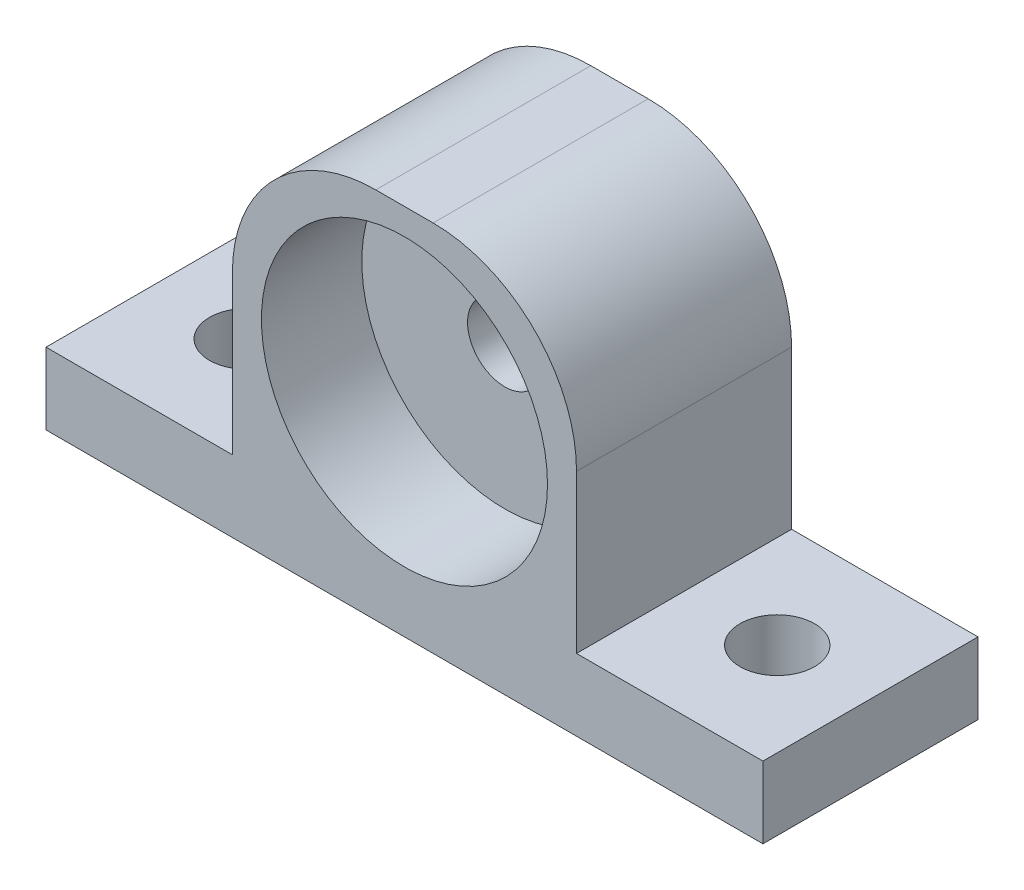
ISO-10303-21;
HEADER;
FILE_DESCRIPTION(('STEP AP214'),'2;1');
FILE_NAME('part.step','',(''),(''),'','','');
FILE_SCHEMA(('AUTOMOTIVE_DESIGN { 1 0 10303 214 1 1 1 1 }'));
ENDSEC;
DATA;
#1=APPLICATION_CONTEXT('core data for automotive mechanical design processes');
#2=APPLICATION_PROTOCOL_DEFINITION('international standard','automotive_design',2000,#1);
#3=PRODUCT_CONTEXT('',#1,'mechanical');
#4=PRODUCT('Part','Part','',(#3));
#5=PRODUCT_RELATED_PRODUCT_CATEGORY('part','',(#4));
#6=PRODUCT_DEFINITION_FORMATION('','',#4);
#7=PRODUCT_DEFINITION_CONTEXT('part definition',#1,'design');
#8=PRODUCT_DEFINITION('design','',#6,#7);
#9=PRODUCT_DEFINITION_SHAPE('','',#8);
#10=(LENGTH_UNIT() NAMED_UNIT(*) SI_UNIT(.MILLI.,.METRE.));
#11=(NAMED_UNIT(*) PLANE_ANGLE_UNIT() SI_UNIT($,.RADIAN.));
#12=(NAMED_UNIT(*) SI_UNIT($,.STERADIAN.) SOLID_ANGLE_UNIT());
#13=UNCERTAINTY_MEASURE_WITH_UNIT(LENGTH_MEASURE(1.E-05),#10,'distance_accuracy_value','');
#14=(GEOMETRIC_REPRESENTATION_CONTEXT(3) GLOBAL_UNCERTAINTY_ASSIGNED_CONTEXT((#13)) GLOBAL_UNIT_ASSIGNED_CONTEXT((#10,
#11,#12)) REPRESENTATION_CONTEXT('',''));
#15=CARTESIAN_POINT('',(0.,0.,0.));
#16=DIRECTION('',(0.,0.,1.));
#17=DIRECTION('',(1.,0.,0.));
#18=AXIS2_PLACEMENT_3D('',#15,#16,#17);
#19=CARTESIAN_POINT('',(0.,6.35,0.));
#20=DIRECTION('',(0.,1.,0.));
#21=DIRECTION('',(0.,0.,1.));
#22=AXIS2_PLACEMENT_3D('',#19,#20,#21);
#23=PLANE('',#22);
#24=CARTESIAN_POINT('',(-54.0324069068638,6.35,-4.28689363659891));
#25=DIRECTION('',(0.,1.,0.));
#26=DIRECTION('',(0.,0.,1.));
#27=AXIS2_PLACEMENT_3D('',#24,#25,#26);
#28=CIRCLE('',#27,3.302);
#29=CARTESIAN_POINT('',(-54.0324069068638,6.35,-0.984893636598909));
#30=VERTEX_POINT('',#29);
#31=EDGE_CURVE('E304',#30,#30,#28,.T.);
#32=ORIENTED_EDGE('',*,*,#31,.F.);
#33=EDGE_LOOP('',(#32));
#34=FACE_BOUND('',#33,.T.);
#35=DIRECTION('',(0.,0.,1.));
#36=VECTOR('',#35,1.);
#37=CARTESIAN_POINT('',(-45.7774069068638,6.35,-13.8118936365989));
#38=LINE('',#37,#36);
#39=CARTESIAN_POINT('',(-45.7774069068638,6.35,-13.8118936365989));
#40=VERTEX_POINT('',#39);
#41=CARTESIAN_POINT('',(-45.7774069068638,6.35,5.23810636340109));
#42=VERTEX_POINT('',#41);
#43=EDGE_CURVE('E133',#40,#42,#38,.T.);
#44=ORIENTED_EDGE('',*,*,#43,.F.);
#45=DIRECTION('',(-1.,0.,0.));
#46=VECTOR('',#45,1.);
#47=CARTESIAN_POINT('',(-62.2874069068638,6.35,-13.8118936365989));
#48=LINE('',#47,#46);
#49=CARTESIAN_POINT('',(-62.2874069068638,6.35,-13.8118936365989));
#50=VERTEX_POINT('',#49);
#51=EDGE_CURVE('E128',#40,#50,#48,.T.);
#52=ORIENTED_EDGE('',*,*,#51,.T.);
#53=DIRECTION('',(0.,0.,1.));
#54=VECTOR('',#53,1.);
#55=CARTESIAN_POINT('',(-62.2874069068638,6.35,-13.8118936365989));
#56=LINE('',#55,#54);
#57=CARTESIAN_POINT('',(-62.2874069068638,6.35,5.23810636340109));
#58=VERTEX_POINT('',#57);
#59=EDGE_CURVE('E152',#50,#58,#56,.T.);
#60=ORIENTED_EDGE('',*,*,#59,.T.);
#61=DIRECTION('',(1.,0.,0.));
#62=VECTOR('',#61,1.);
#63=CARTESIAN_POINT('',(-62.2874069068638,6.35,5.23810636340109));
#64=LINE('',#63,#62);
#65=EDGE_CURVE('E162',#58,#42,#64,.T.);
#66=ORIENTED_EDGE('',*,*,#65,.T.);
#67=EDGE_LOOP('',(#44,#52,#60,#66));
#68=FACE_BOUND('',#67,.T.);
#69=ADVANCED_FACE('F33',(#34,#68),#23,.T.);
#70=CARTESIAN_POINT('',(-62.2874069068638,6.35,-13.8118936365989));
#71=DIRECTION('',(1.,0.,0.));
#72=DIRECTION('',(0.,0.,-1.));
#73=AXIS2_PLACEMENT_3D('',#70,#71,#72);
#74=PLANE('',#73);
#75=DIRECTION('',(0.,0.,1.));
#76=VECTOR('',#75,1.);
#77=CARTESIAN_POINT('',(-62.2874069068638,0.,-13.8118936365989));
#78=LINE('',#77,#76);
#79=CARTESIAN_POINT('',(-62.2874069068638,0.,-13.8118936365989));
#80=VERTEX_POINT('',#79);
#81=CARTESIAN_POINT('',(-62.2874069068638,0.,5.23810636340109));
#82=VERTEX_POINT('',#81);
#83=EDGE_CURVE('E181',#80,#82,#78,.T.);
#84=ORIENTED_EDGE('',*,*,#83,.T.);
#85=DIRECTION('',(0.,-1.,0.));
#86=VECTOR('',#85,1.);
#87=CARTESIAN_POINT('',(-62.2874069068638,6.35,5.23810636340109));
#88=LINE('',#87,#86);
#89=EDGE_CURVE('E165',#58,#82,#88,.T.);
#90=ORIENTED_EDGE('',*,*,#89,.F.);
#91=ORIENTED_EDGE('',*,*,#59,.F.);
#92=DIRECTION('',(0.,-1.,0.));
#93=VECTOR('',#92,1.);
#94=CARTESIAN_POINT('',(-62.2874069068638,6.35,-13.8118936365989));
#95=LINE('',#94,#93);
#96=EDGE_CURVE('E127',#50,#80,#95,.T.);
#97=ORIENTED_EDGE('',*,*,#96,.T.);
#98=EDGE_LOOP('',(#84,#90,#91,#97));
#99=FACE_BOUND('',#98,.T.);
#100=ADVANCED_FACE('F229',(#99),#74,.F.);
#101=CARTESIAN_POINT('',(-62.2874069068638,6.35,5.23810636340109));
#102=DIRECTION('',(0.,0.,-1.));
#103=DIRECTION('',(-1.,0.,0.));
#104=AXIS2_PLACEMENT_3D('',#101,#102,#103);
#105=PLANE('',#104);
#106=CARTESIAN_POINT('',(-30.5374069068637,18.034,5.23810636340109));
#107=DIRECTION('',(0.,0.,1.));
#108=DIRECTION('',(1.,0.,0.));
#109=AXIS2_PLACEMENT_3D('',#106,#107,#108);
#110=CIRCLE('',#109,12.6691049414785);
#111=CARTESIAN_POINT('',(-17.8683019653852,18.034,5.23810636340109));
#112=VERTEX_POINT('',#111);
#113=EDGE_CURVE('E290',#112,#112,#110,.T.);
#114=ORIENTED_EDGE('',*,*,#113,.F.);
#115=EDGE_LOOP('',(#114));
#116=FACE_BOUND('',#115,.T.);
#117=DIRECTION('',(1.,0.,0.));
#118=VECTOR('',#117,1.);
#119=CARTESIAN_POINT('',(-45.7774069068638,33.02,5.23810636340109));
#120=LINE('',#119,#118);
#121=CARTESIAN_POINT('',(-33.0774069068638,33.02,5.23810636340109));
#122=VERTEX_POINT('',#121);
#123=CARTESIAN_POINT('',(-27.9974069068637,33.02,5.23810636340109));
#124=VERTEX_POINT('',#123);
#125=EDGE_CURVE('E132',#122,#124,#120,.T.);
#126=ORIENTED_EDGE('',*,*,#125,.F.);
#127=CARTESIAN_POINT('',(-33.0774069068638,20.32,5.23810636340109));
#128=DIRECTION('',(0.,0.,-1.));
#129=DIRECTION('',(-1.,0.,0.));
#130=AXIS2_PLACEMENT_3D('',#127,#128,#129);
#131=CIRCLE('',#130,12.7);
#132=CARTESIAN_POINT('',(-45.7774069068638,20.32,5.23810636340109));
#133=VERTEX_POINT('',#132);
#134=EDGE_CURVE('E206',#122,#133,#131,.F.);
#135=ORIENTED_EDGE('',*,*,#134,.T.);
#136=DIRECTION('',(0.,-1.,0.));
#137=VECTOR('',#136,1.);
#138=CARTESIAN_POINT('',(-45.7774069068638,33.02,5.23810636340109));
#139=LINE('',#138,#137);
#140=EDGE_CURVE('E183',#133,#42,#139,.T.);
#141=ORIENTED_EDGE('',*,*,#140,.T.);
#142=ORIENTED_EDGE('',*,*,#65,.F.);
#143=ORIENTED_EDGE('',*,*,#89,.T.);
#144=DIRECTION('',(1.,0.,0.));
#145=VECTOR('',#144,1.);
#146=CARTESIAN_POINT('',(-62.2874069068638,0.,5.23810636340109));
#147=LINE('',#146,#145);
#148=CARTESIAN_POINT('',(1.21259309313625,0.,5.23810636340109));
#149=VERTEX_POINT('',#148);
#150=EDGE_CURVE('E179',#82,#149,#147,.T.);
#151=ORIENTED_EDGE('',*,*,#150,.T.);
#152=DIRECTION('',(0.,-1.,0.));
#153=VECTOR('',#152,1.);
#154=CARTESIAN_POINT('',(1.21259309313625,6.35,5.23810636340109));
#155=LINE('',#154,#153);
#156=CARTESIAN_POINT('',(1.21259309313625,6.35,5.23810636340109));
#157=VERTEX_POINT('',#156);
#158=EDGE_CURVE('E169',#157,#149,#155,.T.);
#159=ORIENTED_EDGE('',*,*,#158,.F.);
#160=CARTESIAN_POINT('',(-15.2974069068638,6.35,5.23810636340109));
#161=VERTEX_POINT('',#160);
#162=EDGE_CURVE('E155',#161,#157,#64,.T.);
#163=ORIENTED_EDGE('',*,*,#162,.F.);
#164=DIRECTION('',(0.,-1.,0.));
#165=VECTOR('',#164,1.);
#166=CARTESIAN_POINT('',(-15.2974069068638,33.02,5.23810636340109));
#167=LINE('',#166,#165);
#168=CARTESIAN_POINT('',(-15.2974069068638,20.32,5.23810636340109));
#169=VERTEX_POINT('',#168);
#170=EDGE_CURVE('E116',#169,#161,#167,.T.);
#171=ORIENTED_EDGE('',*,*,#170,.F.);
#172=CARTESIAN_POINT('',(-27.9974069068637,20.32,5.23810636340109));
#173=DIRECTION('',(0.,0.,-1.));
#174=DIRECTION('',(-1.,0.,0.));
#175=AXIS2_PLACEMENT_3D('',#172,#173,#174);
#176=CIRCLE('',#175,12.7);
#177=EDGE_CURVE('E195',#169,#124,#176,.F.);
#178=ORIENTED_EDGE('',*,*,#177,.T.);
#179=EDGE_LOOP('',(#126,#135,#141,#142,#143,#151,#159,#163,#171,#178));
#180=FACE_BOUND('',#179,.T.);
#181=ADVANCED_FACE('F222',(#116,#180),#105,.F.);
#182=CARTESIAN_POINT('',(1.21259309313624,6.35,-13.8118936365989));
#183=DIRECTION('',(-1.,0.,0.));
#184=DIRECTION('',(0.,0.,1.));
#185=AXIS2_PLACEMENT_3D('',#182,#183,#184);
#186=PLANE('',#185);
#187=DIRECTION('',(0.,0.,-1.));
#188=VECTOR('',#187,1.);
#189=CARTESIAN_POINT('',(1.21259309313624,0.,-13.8118936365989));
#190=LINE('',#189,#188);
#191=CARTESIAN_POINT('',(1.21259309313624,0.,-13.8118936365989));
#192=VERTEX_POINT('',#191);
#193=EDGE_CURVE('E177',#149,#192,#190,.T.);
#194=ORIENTED_EDGE('',*,*,#193,.T.);
#195=DIRECTION('',(0.,-1.,0.));
#196=VECTOR('',#195,1.);
#197=CARTESIAN_POINT('',(1.21259309313624,6.35,-13.8118936365989));
#198=LINE('',#197,#196);
#199=CARTESIAN_POINT('',(1.21259309313624,6.35,-13.8118936365989));
#200=VERTEX_POINT('',#199);
#201=EDGE_CURVE('E172',#200,#192,#198,.T.);
#202=ORIENTED_EDGE('',*,*,#201,.F.);
#203=DIRECTION('',(0.,0.,-1.));
#204=VECTOR('',#203,1.);
#205=CARTESIAN_POINT('',(1.21259309313624,6.35,-13.8118936365989));
#206=LINE('',#205,#204);
#207=EDGE_CURVE('E125',#157,#200,#206,.T.);
#208=ORIENTED_EDGE('',*,*,#207,.F.);
#209=ORIENTED_EDGE('',*,*,#158,.T.);
#210=EDGE_LOOP('',(#194,#202,#208,#209));
#211=FACE_BOUND('',#210,.T.);
#212=ADVANCED_FACE('F234',(#211),#186,.F.);
#213=CARTESIAN_POINT('',(-62.2874069068638,6.35,-13.8118936365989));
#214=DIRECTION('',(0.,0.,1.));
#215=DIRECTION('',(1.,0.,0.));
#216=AXIS2_PLACEMENT_3D('',#213,#214,#215);
#217=PLANE('',#216);
#218=CARTESIAN_POINT('',(-30.5374069068637,18.034,-13.8118936365989));
#219=DIRECTION('',(0.,0.,1.));
#220=DIRECTION('',(1.,0.,0.));
#221=AXIS2_PLACEMENT_3D('',#218,#219,#220);
#222=CIRCLE('',#221,3.302);
#223=CARTESIAN_POINT('',(-27.2354069068637,18.034,-13.8118936365989));
#224=VERTEX_POINT('',#223);
#225=EDGE_CURVE('E288',#224,#224,#222,.T.);
#226=ORIENTED_EDGE('',*,*,#225,.T.);
#227=EDGE_LOOP('',(#226));
#228=FACE_BOUND('',#227,.T.);
#229=DIRECTION('',(0.,-1.,0.));
#230=VECTOR('',#229,1.);
#231=CARTESIAN_POINT('',(-45.7774069068638,33.02,-13.8118936365989));
#232=LINE('',#231,#230);
#233=CARTESIAN_POINT('',(-45.7774069068638,20.32,-13.8118936365989));
#234=VERTEX_POINT('',#233);
#235=EDGE_CURVE('E117',#234,#40,#232,.T.);
#236=ORIENTED_EDGE('',*,*,#235,.F.);
#237=CARTESIAN_POINT('',(-33.0774069068638,20.32,-13.8118936365989));
#238=DIRECTION('',(0.,0.,1.));
#239=DIRECTION('',(1.,0.,0.));
#240=AXIS2_PLACEMENT_3D('',#237,#238,#239);
#241=CIRCLE('',#240,12.7);
#242=CARTESIAN_POINT('',(-33.0774069068638,33.02,-13.8118936365989));
#243=VERTEX_POINT('',#242);
#244=EDGE_CURVE('E41',#234,#243,#241,.F.);
#245=ORIENTED_EDGE('',*,*,#244,.T.);
#246=DIRECTION('',(-1.,0.,0.));
#247=VECTOR('',#246,1.);
#248=CARTESIAN_POINT('',(-45.7774069068638,33.02,-13.8118936365989));
#249=LINE('',#248,#247);
#250=CARTESIAN_POINT('',(-27.9974069068637,33.02,-13.8118936365989));
#251=VERTEX_POINT('',#250);
#252=EDGE_CURVE('E136',#251,#243,#249,.T.);
#253=ORIENTED_EDGE('',*,*,#252,.F.);
#254=CARTESIAN_POINT('',(-27.9974069068637,20.32,-13.8118936365989));
#255=DIRECTION('',(0.,0.,1.));
#256=DIRECTION('',(1.,0.,0.));
#257=AXIS2_PLACEMENT_3D('',#254,#255,#256);
#258=CIRCLE('',#257,12.7);
#259=CARTESIAN_POINT('',(-15.2974069068638,20.32,-13.8118936365989));
#260=VERTEX_POINT('',#259);
#261=EDGE_CURVE('E48',#251,#260,#258,.F.);
#262=ORIENTED_EDGE('',*,*,#261,.T.);
#263=DIRECTION('',(0.,-1.,0.));
#264=VECTOR('',#263,1.);
#265=CARTESIAN_POINT('',(-15.2974069068638,33.02,-13.8118936365989));
#266=LINE('',#265,#264);
#267=CARTESIAN_POINT('',(-15.2974069068638,6.35,-13.8118936365989));
#268=VERTEX_POINT('',#267);
#269=EDGE_CURVE('E108',#260,#268,#266,.T.);
#270=ORIENTED_EDGE('',*,*,#269,.T.);
#271=EDGE_CURVE('E112',#200,#268,#48,.T.);
#272=ORIENTED_EDGE('',*,*,#271,.F.);
#273=ORIENTED_EDGE('',*,*,#201,.T.);
#274=DIRECTION('',(-1.,0.,0.));
#275=VECTOR('',#274,1.);
#276=CARTESIAN_POINT('',(-62.2874069068638,0.,-13.8118936365989));
#277=LINE('',#276,#275);
#278=EDGE_CURVE('E156',#192,#80,#277,.T.);
#279=ORIENTED_EDGE('',*,*,#278,.T.);
#280=ORIENTED_EDGE('',*,*,#96,.F.);
#281=ORIENTED_EDGE('',*,*,#51,.F.);
#282=EDGE_LOOP('',(#236,#245,#253,#262,#270,#272,#273,#279,#280,#281));
#283=FACE_BOUND('',#282,.T.);
#284=ADVANCED_FACE('F110',(#228,#283),#217,.F.);
#285=CARTESIAN_POINT('',(-7.04240690686375,6.35,-4.28689363659891));
#286=DIRECTION('',(0.,1.,0.));
#287=DIRECTION('',(0.,0.,1.));
#288=AXIS2_PLACEMENT_3D('',#285,#286,#287);
#289=CIRCLE('',#288,3.302);
#290=CARTESIAN_POINT('',(-7.04240690686375,6.35,-0.984893636598907));
#291=VERTEX_POINT('',#290);
#292=EDGE_CURVE('E297',#291,#291,#289,.T.);
#293=ORIENTED_EDGE('',*,*,#292,.F.);
#294=EDGE_LOOP('',(#293));
#295=FACE_BOUND('',#294,.T.);
#296=DIRECTION('',(0.,0.,-1.));
#297=VECTOR('',#296,1.);
#298=CARTESIAN_POINT('',(-15.2974069068638,6.35,-13.8118936365989));
#299=LINE('',#298,#297);
#300=EDGE_CURVE('E122',#161,#268,#299,.T.);
#301=ORIENTED_EDGE('',*,*,#300,.F.);
#302=ORIENTED_EDGE('',*,*,#162,.T.);
#303=ORIENTED_EDGE('',*,*,#207,.T.);
#304=ORIENTED_EDGE('',*,*,#271,.T.);
#305=EDGE_LOOP('',(#301,#302,#303,#304));
#306=FACE_BOUND('',#305,.T.);
#307=ADVANCED_FACE('F121',(#295,#306),#23,.T.);
#308=CARTESIAN_POINT('',(0.,0.,0.));
#309=DIRECTION('',(0.,1.,0.));
#310=DIRECTION('',(0.,0.,1.));
#311=AXIS2_PLACEMENT_3D('',#308,#309,#310);
#312=PLANE('',#311);
#313=CARTESIAN_POINT('',(-7.04240690686375,0.,-4.28689363659891));
#314=DIRECTION('',(0.,1.,0.));
#315=DIRECTION('',(0.,0.,1.));
#316=AXIS2_PLACEMENT_3D('',#313,#314,#315);
#317=CIRCLE('',#316,3.302);
#318=CARTESIAN_POINT('',(-7.04240690686375,0.,-0.984893636598907));
#319=VERTEX_POINT('',#318);
#320=EDGE_CURVE('E301',#319,#319,#317,.F.);
#321=ORIENTED_EDGE('',*,*,#320,.F.);
#322=EDGE_LOOP('',(#321));
#323=FACE_BOUND('',#322,.T.);
#324=CARTESIAN_POINT('',(-54.0324069068638,0.,-4.28689363659891));
#325=DIRECTION('',(0.,1.,0.));
#326=DIRECTION('',(0.,0.,1.));
#327=AXIS2_PLACEMENT_3D('',#324,#325,#326);
#328=CIRCLE('',#327,3.302);
#329=CARTESIAN_POINT('',(-54.0324069068638,0.,-0.984893636598909));
#330=VERTEX_POINT('',#329);
#331=EDGE_CURVE('E139',#330,#330,#328,.F.);
#332=ORIENTED_EDGE('',*,*,#331,.F.);
#333=EDGE_LOOP('',(#332));
#334=FACE_BOUND('',#333,.T.);
#335=ORIENTED_EDGE('',*,*,#83,.F.);
#336=ORIENTED_EDGE('',*,*,#278,.F.);
#337=ORIENTED_EDGE('',*,*,#193,.F.);
#338=ORIENTED_EDGE('',*,*,#150,.F.);
#339=EDGE_LOOP('',(#335,#336,#337,#338));
#340=FACE_BOUND('',#339,.T.);
#341=ADVANCED_FACE('F235',(#323,#334,#340),#312,.F.);
#342=CARTESIAN_POINT('',(-45.7774069068638,33.02,-13.8118936365989));
#343=DIRECTION('',(1.,0.,0.));
#344=DIRECTION('',(0.,0.,-1.));
#345=AXIS2_PLACEMENT_3D('',#342,#343,#344);
#346=PLANE('',#345);
#347=ORIENTED_EDGE('',*,*,#140,.F.);
#348=DIRECTION('',(0.,0.,1.));
#349=VECTOR('',#348,1.);
#350=CARTESIAN_POINT('',(-45.7774069068638,20.32,-13.8118936365989));
#351=LINE('',#350,#349);
#352=EDGE_CURVE('E56',#133,#234,#351,.F.);
#353=ORIENTED_EDGE('',*,*,#352,.T.);
#354=ORIENTED_EDGE('',*,*,#235,.T.);
#355=ORIENTED_EDGE('',*,*,#43,.T.);
#356=EDGE_LOOP('',(#347,#353,#354,#355));
#357=FACE_BOUND('',#356,.T.);
#358=ADVANCED_FACE('F223',(#357),#346,.F.);
#359=CARTESIAN_POINT('',(-15.2974069068638,33.02,-13.8118936365989));
#360=DIRECTION('',(-1.,0.,0.));
#361=DIRECTION('',(0.,0.,1.));
#362=AXIS2_PLACEMENT_3D('',#359,#360,#361);
#363=PLANE('',#362);
#364=ORIENTED_EDGE('',*,*,#269,.F.);
#365=DIRECTION('',(0.,0.,-1.));
#366=VECTOR('',#365,1.);
#367=CARTESIAN_POINT('',(-15.2974069068638,20.32,5.23810636340109));
#368=LINE('',#367,#366);
#369=EDGE_CURVE('E11',#260,#169,#368,.F.);
#370=ORIENTED_EDGE('',*,*,#369,.T.);
#371=ORIENTED_EDGE('',*,*,#170,.T.);
#372=ORIENTED_EDGE('',*,*,#300,.T.);
#373=EDGE_LOOP('',(#364,#370,#371,#372));
#374=FACE_BOUND('',#373,.T.);
#375=ADVANCED_FACE('F130',(#374),#363,.F.);
#376=CARTESIAN_POINT('',(0.,33.02,0.));
#377=DIRECTION('',(0.,1.,0.));
#378=DIRECTION('',(0.,0.,1.));
#379=AXIS2_PLACEMENT_3D('',#376,#377,#378);
#380=PLANE('',#379);
#381=ORIENTED_EDGE('',*,*,#252,.T.);
#382=DIRECTION('',(0.,0.,1.));
#383=VECTOR('',#382,1.);
#384=CARTESIAN_POINT('',(-33.0774069068638,33.02,5.23810636340109));
#385=LINE('',#384,#383);
#386=EDGE_CURVE('E217',#243,#122,#385,.T.);
#387=ORIENTED_EDGE('',*,*,#386,.T.);
#388=ORIENTED_EDGE('',*,*,#125,.T.);
#389=DIRECTION('',(0.,0.,-1.));
#390=VECTOR('',#389,1.);
#391=CARTESIAN_POINT('',(-27.9974069068637,33.02,-13.8118936365989));
#392=LINE('',#391,#390);
#393=EDGE_CURVE('E168',#124,#251,#392,.T.);
#394=ORIENTED_EDGE('',*,*,#393,.T.);
#395=EDGE_LOOP('',(#381,#387,#388,#394));
#396=FACE_BOUND('',#395,.T.);
#397=ADVANCED_FACE('F216',(#396),#380,.T.);
#398=CARTESIAN_POINT('',(-54.0324069068638,-0.00100000000000013,-4.28689363659891));
#399=DIRECTION('',(0.,1.,0.));
#400=DIRECTION('',(0.,0.,1.));
#401=AXIS2_PLACEMENT_3D('',#398,#399,#400);
#402=CYLINDRICAL_SURFACE('',#401,3.302);
#403=ORIENTED_EDGE('',*,*,#31,.T.);
#404=EDGE_LOOP('',(#403));
#405=FACE_BOUND('',#404,.T.);
#406=ORIENTED_EDGE('',*,*,#331,.T.);
#407=EDGE_LOOP('',(#406));
#408=FACE_BOUND('',#407,.T.);
#409=ADVANCED_FACE('F261',(#405,#408),#402,.F.);
#410=CARTESIAN_POINT('',(-7.04240690686375,-0.00100000000000013,-4.28689363659891));
#411=DIRECTION('',(0.,1.,0.));
#412=DIRECTION('',(0.,0.,1.));
#413=AXIS2_PLACEMENT_3D('',#410,#411,#412);
#414=CYLINDRICAL_SURFACE('',#413,3.302);
#415=ORIENTED_EDGE('',*,*,#292,.T.);
#416=EDGE_LOOP('',(#415));
#417=FACE_BOUND('',#416,.T.);
#418=ORIENTED_EDGE('',*,*,#320,.T.);
#419=EDGE_LOOP('',(#418));
#420=FACE_BOUND('',#419,.T.);
#421=ADVANCED_FACE('F264',(#417,#420),#414,.F.);
#422=CARTESIAN_POINT('',(-30.5374069068637,18.034,-3.65189363659891));
#423=DIRECTION('',(0.,0.,1.));
#424=DIRECTION('',(1.,0.,0.));
#425=AXIS2_PLACEMENT_3D('',#422,#423,#424);
#426=CYLINDRICAL_SURFACE('',#425,12.6691049414785);
#427=CARTESIAN_POINT('',(-30.5374069068637,18.034,-3.65189363659891));
#428=DIRECTION('',(0.,0.,1.));
#429=DIRECTION('',(1.,0.,0.));
#430=AXIS2_PLACEMENT_3D('',#427,#428,#429);
#431=CIRCLE('',#430,12.6691049414785);
#432=CARTESIAN_POINT('',(-17.8683019653852,18.034,-3.65189363659891));
#433=VERTEX_POINT('',#432);
#434=EDGE_CURVE('E293',#433,#433,#431,.T.);
#435=ORIENTED_EDGE('',*,*,#434,.F.);
#436=EDGE_LOOP('',(#435));
#437=FACE_BOUND('',#436,.T.);
#438=ORIENTED_EDGE('',*,*,#113,.T.);
#439=EDGE_LOOP('',(#438));
#440=FACE_BOUND('',#439,.T.);
#441=ADVANCED_FACE('F268',(#437,#440),#426,.F.);
#442=CARTESIAN_POINT('',(-30.5374069068637,18.034,-3.65189363659891));
#443=DIRECTION('',(0.,0.,1.));
#444=DIRECTION('',(1.,0.,0.));
#445=AXIS2_PLACEMENT_3D('',#442,#443,#444);
#446=PLANE('',#445);
#447=CARTESIAN_POINT('',(-30.5374069068637,18.034,-3.65189363659891));
#448=DIRECTION('',(0.,0.,1.));
#449=DIRECTION('',(1.,0.,0.));
#450=AXIS2_PLACEMENT_3D('',#447,#448,#449);
#451=CIRCLE('',#450,3.302);
#452=CARTESIAN_POINT('',(-27.2354069068637,18.034,-3.65189363659891));
#453=VERTEX_POINT('',#452);
#454=EDGE_CURVE('E202',#453,#453,#451,.T.);
#455=ORIENTED_EDGE('',*,*,#454,.F.);
#456=EDGE_LOOP('',(#455));
#457=FACE_BOUND('',#456,.T.);
#458=ORIENTED_EDGE('',*,*,#434,.T.);
#459=EDGE_LOOP('',(#458));
#460=FACE_BOUND('',#459,.T.);
#461=ADVANCED_FACE('F272',(#457,#460),#446,.T.);
#462=CARTESIAN_POINT('',(-30.5374069068637,18.034,-13.8119436365989));
#463=DIRECTION('',(0.,0.,1.));
#464=DIRECTION('',(1.,0.,0.));
#465=AXIS2_PLACEMENT_3D('',#462,#463,#464);
#466=CYLINDRICAL_SURFACE('',#465,3.302);
#467=ORIENTED_EDGE('',*,*,#454,.T.);
#468=EDGE_LOOP('',(#467));
#469=FACE_BOUND('',#468,.T.);
#470=ORIENTED_EDGE('',*,*,#225,.F.);
#471=EDGE_LOOP('',(#470));
#472=FACE_BOUND('',#471,.T.);
#473=ADVANCED_FACE('F276',(#469,#472),#466,.F.);
#474=CARTESIAN_POINT('',(-33.0774069068638,20.32,0.));
#475=DIRECTION('',(0.,0.,-1.));
#476=DIRECTION('',(-1.,0.,0.));
#477=AXIS2_PLACEMENT_3D('',#474,#475,#476);
#478=CYLINDRICAL_SURFACE('',#477,12.7);
#479=ORIENTED_EDGE('',*,*,#244,.F.);
#480=ORIENTED_EDGE('',*,*,#352,.F.);
#481=ORIENTED_EDGE('',*,*,#134,.F.);
#482=ORIENTED_EDGE('',*,*,#386,.F.);
#483=EDGE_LOOP('',(#479,#480,#481,#482));
#484=FACE_BOUND('',#483,.T.);
#485=ADVANCED_FACE('F220',(#484),#478,.T.);
#486=CARTESIAN_POINT('',(-27.9974069068637,20.32,0.));
#487=DIRECTION('',(0.,0.,1.));
#488=DIRECTION('',(1.,0.,0.));
#489=AXIS2_PLACEMENT_3D('',#486,#487,#488);
#490=CYLINDRICAL_SURFACE('',#489,12.7);
#491=ORIENTED_EDGE('',*,*,#177,.F.);
#492=ORIENTED_EDGE('',*,*,#369,.F.);
#493=ORIENTED_EDGE('',*,*,#261,.F.);
#494=ORIENTED_EDGE('',*,*,#393,.F.);
#495=EDGE_LOOP('',(#491,#492,#493,#494));
#496=FACE_BOUND('',#495,.T.);
#497=ADVANCED_FACE('F35',(#496),#490,.T.);
#498=CLOSED_SHELL('',(#69,#100,#181,#212,#284,#307,#341,#358,#375,#397,#409,#421,#441,#461,#473,
#485,#497));
#499=MANIFOLD_SOLID_BREP('B2',#498);
#500=ADVANCED_BREP_SHAPE_REPRESENTATION('',(#18,#499),#14);
#501=SHAPE_DEFINITION_REPRESENTATION(#9,#500);
ENDSEC;
END-ISO-10303-21;
